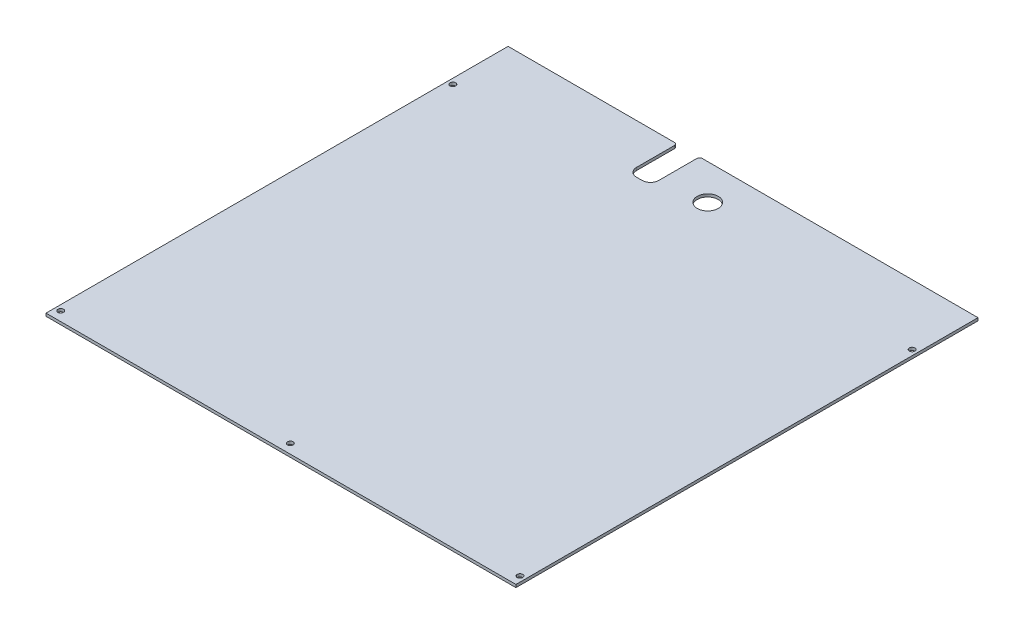
ISO-10303-21;
HEADER;
FILE_DESCRIPTION(('STEP AP214'),'2;1');
FILE_NAME('part.step','',(''),(''),'','','');
FILE_SCHEMA(('AUTOMOTIVE_DESIGN { 1 0 10303 214 1 1 1 1 }'));
ENDSEC;
DATA;
#1=APPLICATION_CONTEXT('core data for automotive mechanical design processes');
#2=APPLICATION_PROTOCOL_DEFINITION('international standard','automotive_design',2000,#1);
#3=PRODUCT_CONTEXT('',#1,'mechanical');
#4=PRODUCT('Part','Part','',(#3));
#5=PRODUCT_RELATED_PRODUCT_CATEGORY('part','',(#4));
#6=PRODUCT_DEFINITION_FORMATION('','',#4);
#7=PRODUCT_DEFINITION_CONTEXT('part definition',#1,'design');
#8=PRODUCT_DEFINITION('design','',#6,#7);
#9=PRODUCT_DEFINITION_SHAPE('','',#8);
#10=(LENGTH_UNIT() NAMED_UNIT(*) SI_UNIT(.MILLI.,.METRE.));
#11=(NAMED_UNIT(*) PLANE_ANGLE_UNIT() SI_UNIT($,.RADIAN.));
#12=(NAMED_UNIT(*) SI_UNIT($,.STERADIAN.) SOLID_ANGLE_UNIT());
#13=UNCERTAINTY_MEASURE_WITH_UNIT(LENGTH_MEASURE(1.E-05),#10,'distance_accuracy_value','');
#14=(GEOMETRIC_REPRESENTATION_CONTEXT(3) GLOBAL_UNCERTAINTY_ASSIGNED_CONTEXT((#13)) GLOBAL_UNIT_ASSIGNED_CONTEXT((#10,
#11,#12)) REPRESENTATION_CONTEXT('',''));
#15=CARTESIAN_POINT('',(0.,0.,0.));
#16=DIRECTION('',(0.,0.,1.));
#17=DIRECTION('',(1.,0.,0.));
#18=AXIS2_PLACEMENT_3D('',#15,#16,#17);
#19=CARTESIAN_POINT('',(-167.5,-2.,-121.41));
#20=DIRECTION('',(0.,0.,-1.));
#21=DIRECTION('',(-1.,0.,0.));
#22=AXIS2_PLACEMENT_3D('',#19,#20,#21);
#23=PLANE('',#22);
#24=DIRECTION('',(-1.,0.,0.));
#25=VECTOR('',#24,1.);
#26=CARTESIAN_POINT('',(-167.5,0.,-121.41));
#27=LINE('',#26,#25);
#28=CARTESIAN_POINT('',(-49.,0.,-121.41));
#29=VERTEX_POINT('',#28);
#30=CARTESIAN_POINT('',(-167.5,0.,-121.41));
#31=VERTEX_POINT('',#30);
#32=EDGE_CURVE('E177',#29,#31,#27,.T.);
#33=ORIENTED_EDGE('',*,*,#32,.F.);
#34=DIRECTION('',(0.,1.,0.));
#35=VECTOR('',#34,1.);
#36=CARTESIAN_POINT('',(-49.,-2.,-121.41));
#37=LINE('',#36,#35);
#38=CARTESIAN_POINT('',(-49.,-2.,-121.41));
#39=VERTEX_POINT('',#38);
#40=EDGE_CURVE('E11',#29,#39,#37,.F.);
#41=ORIENTED_EDGE('',*,*,#40,.T.);
#42=DIRECTION('',(-1.,0.,0.));
#43=VECTOR('',#42,1.);
#44=CARTESIAN_POINT('',(-167.5,-2.,-121.41));
#45=LINE('',#44,#43);
#46=CARTESIAN_POINT('',(-167.5,-2.,-121.41));
#47=VERTEX_POINT('',#46);
#48=EDGE_CURVE('E159',#39,#47,#45,.T.);
#49=ORIENTED_EDGE('',*,*,#48,.T.);
#50=DIRECTION('',(0.,1.,0.));
#51=VECTOR('',#50,1.);
#52=CARTESIAN_POINT('',(-167.5,-2.,-121.41));
#53=LINE('',#52,#51);
#54=EDGE_CURVE('E146',#47,#31,#53,.T.);
#55=ORIENTED_EDGE('',*,*,#54,.T.);
#56=EDGE_LOOP('',(#33,#41,#49,#55));
#57=FACE_BOUND('',#56,.T.);
#58=ADVANCED_FACE('F46',(#57),#23,.T.);
#59=CARTESIAN_POINT('',(167.5,-2.,207.99));
#60=DIRECTION('',(1.,0.,0.));
#61=DIRECTION('',(0.,0.,-1.));
#62=AXIS2_PLACEMENT_3D('',#59,#60,#61);
#63=PLANE('',#62);
#64=DIRECTION('',(0.,0.,-1.));
#65=VECTOR('',#64,1.);
#66=CARTESIAN_POINT('',(167.5,0.,207.99));
#67=LINE('',#66,#65);
#68=CARTESIAN_POINT('',(167.5,0.,207.99));
#69=VERTEX_POINT('',#68);
#70=CARTESIAN_POINT('',(167.5,0.,-121.41));
#71=VERTEX_POINT('',#70);
#72=EDGE_CURVE('E175',#69,#71,#67,.T.);
#73=ORIENTED_EDGE('',*,*,#72,.F.);
#74=DIRECTION('',(0.,1.,0.));
#75=VECTOR('',#74,1.);
#76=CARTESIAN_POINT('',(167.5,-2.,207.99));
#77=LINE('',#76,#75);
#78=CARTESIAN_POINT('',(167.5,-2.,207.99));
#79=VERTEX_POINT('',#78);
#80=EDGE_CURVE('E162',#79,#69,#77,.T.);
#81=ORIENTED_EDGE('',*,*,#80,.F.);
#82=DIRECTION('',(0.,0.,-1.));
#83=VECTOR('',#82,1.);
#84=CARTESIAN_POINT('',(167.5,-2.,207.99));
#85=LINE('',#84,#83);
#86=CARTESIAN_POINT('',(167.5,-2.,-121.41));
#87=VERTEX_POINT('',#86);
#88=EDGE_CURVE('E154',#79,#87,#85,.T.);
#89=ORIENTED_EDGE('',*,*,#88,.T.);
#90=DIRECTION('',(0.,1.,0.));
#91=VECTOR('',#90,1.);
#92=CARTESIAN_POINT('',(167.5,-2.,-121.41));
#93=LINE('',#92,#91);
#94=EDGE_CURVE('E134',#87,#71,#93,.T.);
#95=ORIENTED_EDGE('',*,*,#94,.T.);
#96=EDGE_LOOP('',(#73,#81,#89,#95));
#97=FACE_BOUND('',#96,.T.);
#98=ADVANCED_FACE('F161',(#97),#63,.T.);
#99=CARTESIAN_POINT('',(-167.5,-2.,207.99));
#100=DIRECTION('',(0.,0.,1.));
#101=DIRECTION('',(1.,0.,0.));
#102=AXIS2_PLACEMENT_3D('',#99,#100,#101);
#103=PLANE('',#102);
#104=DIRECTION('',(1.,0.,0.));
#105=VECTOR('',#104,1.);
#106=CARTESIAN_POINT('',(-167.5,0.,207.99));
#107=LINE('',#106,#105);
#108=CARTESIAN_POINT('',(-167.5,0.,207.99));
#109=VERTEX_POINT('',#108);
#110=EDGE_CURVE('E163',#109,#69,#107,.T.);
#111=ORIENTED_EDGE('',*,*,#110,.F.);
#112=DIRECTION('',(0.,1.,0.));
#113=VECTOR('',#112,1.);
#114=CARTESIAN_POINT('',(-167.5,-2.,207.99));
#115=LINE('',#114,#113);
#116=CARTESIAN_POINT('',(-167.5,-2.,207.99));
#117=VERTEX_POINT('',#116);
#118=EDGE_CURVE('E184',#117,#109,#115,.T.);
#119=ORIENTED_EDGE('',*,*,#118,.F.);
#120=DIRECTION('',(1.,0.,0.));
#121=VECTOR('',#120,1.);
#122=CARTESIAN_POINT('',(-167.5,-2.,207.99));
#123=LINE('',#122,#121);
#124=EDGE_CURVE('E147',#117,#79,#123,.T.);
#125=ORIENTED_EDGE('',*,*,#124,.T.);
#126=ORIENTED_EDGE('',*,*,#80,.T.);
#127=EDGE_LOOP('',(#111,#119,#125,#126));
#128=FACE_BOUND('',#127,.T.);
#129=ADVANCED_FACE('F294',(#128),#103,.T.);
#130=CARTESIAN_POINT('',(-167.5,-2.,207.99));
#131=DIRECTION('',(-1.,0.,0.));
#132=DIRECTION('',(0.,0.,1.));
#133=AXIS2_PLACEMENT_3D('',#130,#131,#132);
#134=PLANE('',#133);
#135=DIRECTION('',(0.,0.,1.));
#136=VECTOR('',#135,1.);
#137=CARTESIAN_POINT('',(-167.5,0.,207.99));
#138=LINE('',#137,#136);
#139=EDGE_CURVE('E166',#31,#109,#138,.T.);
#140=ORIENTED_EDGE('',*,*,#139,.F.);
#141=ORIENTED_EDGE('',*,*,#54,.F.);
#142=DIRECTION('',(0.,0.,1.));
#143=VECTOR('',#142,1.);
#144=CARTESIAN_POINT('',(-167.5,-2.,207.99));
#145=LINE('',#144,#143);
#146=EDGE_CURVE('E158',#47,#117,#145,.T.);
#147=ORIENTED_EDGE('',*,*,#146,.T.);
#148=ORIENTED_EDGE('',*,*,#118,.T.);
#149=EDGE_LOOP('',(#140,#141,#147,#148));
#150=FACE_BOUND('',#149,.T.);
#151=ADVANCED_FACE('F298',(#150),#134,.T.);
#152=CARTESIAN_POINT('',(-29.,-2.,-121.41));
#153=VERTEX_POINT('',#152);
#154=EDGE_CURVE('E138',#87,#153,#45,.T.);
#155=ORIENTED_EDGE('',*,*,#154,.T.);
#156=DIRECTION('',(0.,1.,0.));
#157=VECTOR('',#156,1.);
#158=CARTESIAN_POINT('',(-29.,0.,-121.41));
#159=LINE('',#158,#157);
#160=CARTESIAN_POINT('',(-29.,0.,-121.41));
#161=VERTEX_POINT('',#160);
#162=EDGE_CURVE('E207',#153,#161,#159,.T.);
#163=ORIENTED_EDGE('',*,*,#162,.T.);
#164=EDGE_CURVE('E141',#71,#161,#27,.T.);
#165=ORIENTED_EDGE('',*,*,#164,.F.);
#166=ORIENTED_EDGE('',*,*,#94,.F.);
#167=EDGE_LOOP('',(#155,#163,#165,#166));
#168=FACE_BOUND('',#167,.T.);
#169=ADVANCED_FACE('F136',(#168),#23,.T.);
#170=CARTESIAN_POINT('',(0.,-2.,0.));
#171=DIRECTION('',(0.,-1.,0.));
#172=DIRECTION('',(0.,0.,-1.));
#173=AXIS2_PLACEMENT_3D('',#170,#171,#172);
#174=PLANE('',#173);
#175=DIRECTION('',(0.,0.,-1.));
#176=VECTOR('',#175,1.);
#177=CARTESIAN_POINT('',(-31.,-2.,-121.41));
#178=LINE('',#177,#176);
#179=CARTESIAN_POINT('',(-31.,-2.,-92.41));
#180=VERTEX_POINT('',#179);
#181=CARTESIAN_POINT('',(-31.,-2.,-119.41));
#182=VERTEX_POINT('',#181);
#183=EDGE_CURVE('E234',#180,#182,#178,.T.);
#184=ORIENTED_EDGE('',*,*,#183,.T.);
#185=CARTESIAN_POINT('',(-29.,-2.,-119.41));
#186=DIRECTION('',(0.,-1.,0.));
#187=DIRECTION('',(0.,0.,-1.));
#188=AXIS2_PLACEMENT_3D('',#185,#186,#187);
#189=CIRCLE('',#188,2.);
#190=EDGE_CURVE('E157',#182,#153,#189,.T.);
#191=ORIENTED_EDGE('',*,*,#190,.T.);
#192=ORIENTED_EDGE('',*,*,#154,.F.);
#193=ORIENTED_EDGE('',*,*,#88,.F.);
#194=ORIENTED_EDGE('',*,*,#124,.F.);
#195=ORIENTED_EDGE('',*,*,#146,.F.);
#196=ORIENTED_EDGE('',*,*,#48,.F.);
#197=CARTESIAN_POINT('',(-49.,-2.,-119.41));
#198=DIRECTION('',(0.,-1.,0.));
#199=DIRECTION('',(0.,0.,-1.));
#200=AXIS2_PLACEMENT_3D('',#197,#198,#199);
#201=CIRCLE('',#200,2.);
#202=CARTESIAN_POINT('',(-47.,-2.,-119.41));
#203=VERTEX_POINT('',#202);
#204=EDGE_CURVE('E66',#39,#203,#201,.T.);
#205=ORIENTED_EDGE('',*,*,#204,.T.);
#206=DIRECTION('',(0.,0.,1.));
#207=VECTOR('',#206,1.);
#208=CARTESIAN_POINT('',(-47.,-2.,-121.41));
#209=LINE('',#208,#207);
#210=CARTESIAN_POINT('',(-47.,-2.,-92.41));
#211=VERTEX_POINT('',#210);
#212=EDGE_CURVE('E222',#203,#211,#209,.T.);
#213=ORIENTED_EDGE('',*,*,#212,.T.);
#214=CARTESIAN_POINT('',(-41.,-2.,-92.41));
#215=DIRECTION('',(0.,-1.,0.));
#216=DIRECTION('',(0.,0.,-1.));
#217=AXIS2_PLACEMENT_3D('',#214,#215,#216);
#218=CIRCLE('',#217,6.);
#219=CARTESIAN_POINT('',(-41.,-2.,-86.41));
#220=VERTEX_POINT('',#219);
#221=EDGE_CURVE('E205',#211,#220,#218,.F.);
#222=ORIENTED_EDGE('',*,*,#221,.T.);
#223=DIRECTION('',(1.,0.,0.));
#224=VECTOR('',#223,1.);
#225=CARTESIAN_POINT('',(-47.,-2.,-86.41));
#226=LINE('',#225,#224);
#227=CARTESIAN_POINT('',(-37.,-2.,-86.41));
#228=VERTEX_POINT('',#227);
#229=EDGE_CURVE('E343',#220,#228,#226,.T.);
#230=ORIENTED_EDGE('',*,*,#229,.T.);
#231=CARTESIAN_POINT('',(-37.,-2.,-92.41));
#232=DIRECTION('',(0.,-1.,0.));
#233=DIRECTION('',(0.,0.,-1.));
#234=AXIS2_PLACEMENT_3D('',#231,#232,#233);
#235=CIRCLE('',#234,6.);
#236=EDGE_CURVE('E200',#228,#180,#235,.F.);
#237=ORIENTED_EDGE('',*,*,#236,.T.);
#238=EDGE_LOOP('',(#184,#191,#192,#193,#194,#195,#196,#205,#213,#222,#230,#237));
#239=FACE_BOUND('',#238,.T.);
#240=CARTESIAN_POINT('',(0.,-2.,-96.25));
#241=DIRECTION('',(0.,-1.,0.));
#242=DIRECTION('',(0.,0.,-1.));
#243=AXIS2_PLACEMENT_3D('',#240,#241,#242);
#244=CIRCLE('',#243,7.5);
#245=CARTESIAN_POINT('',(0.,-2.,-103.75));
#246=VERTEX_POINT('',#245);
#247=EDGE_CURVE('E243',#246,#246,#244,.F.);
#248=ORIENTED_EDGE('',*,*,#247,.T.);
#249=EDGE_LOOP('',(#248));
#250=FACE_BOUND('',#249,.T.);
#251=CARTESIAN_POINT('',(0.,-2.,201.3));
#252=DIRECTION('',(0.,-1.,0.));
#253=DIRECTION('',(0.,0.,-1.));
#254=AXIS2_PLACEMENT_3D('',#251,#252,#253);
#255=CIRCLE('',#254,2.);
#256=CARTESIAN_POINT('',(0.,-2.,199.3));
#257=VERTEX_POINT('',#256);
#258=EDGE_CURVE('E242',#257,#257,#255,.F.);
#259=ORIENTED_EDGE('',*,*,#258,.T.);
#260=EDGE_LOOP('',(#259));
#261=FACE_BOUND('',#260,.T.);
#262=CARTESIAN_POINT('',(163.7,-2.,201.3));
#263=DIRECTION('',(0.,-1.,0.));
#264=DIRECTION('',(0.,0.,-1.));
#265=AXIS2_PLACEMENT_3D('',#262,#263,#264);
#266=CIRCLE('',#265,2.);
#267=CARTESIAN_POINT('',(163.7,-2.,199.3));
#268=VERTEX_POINT('',#267);
#269=EDGE_CURVE('E249',#268,#268,#266,.F.);
#270=ORIENTED_EDGE('',*,*,#269,.T.);
#271=EDGE_LOOP('',(#270));
#272=FACE_BOUND('',#271,.T.);
#273=CARTESIAN_POINT('',(163.7,-2.,-78.26));
#274=DIRECTION('',(0.,-1.,0.));
#275=DIRECTION('',(0.,0.,-1.));
#276=AXIS2_PLACEMENT_3D('',#273,#274,#275);
#277=CIRCLE('',#276,2.);
#278=CARTESIAN_POINT('',(163.7,-2.,-80.26));
#279=VERTEX_POINT('',#278);
#280=EDGE_CURVE('E255',#279,#279,#277,.F.);
#281=ORIENTED_EDGE('',*,*,#280,.T.);
#282=EDGE_LOOP('',(#281));
#283=FACE_BOUND('',#282,.T.);
#284=CARTESIAN_POINT('',(-163.7,-2.,-78.2599999999999));
#285=DIRECTION('',(0.,-1.,0.));
#286=DIRECTION('',(0.,0.,-1.));
#287=AXIS2_PLACEMENT_3D('',#284,#285,#286);
#288=CIRCLE('',#287,2.);
#289=CARTESIAN_POINT('',(-163.7,-2.,-80.2599999999999));
#290=VERTEX_POINT('',#289);
#291=EDGE_CURVE('E261',#290,#290,#288,.F.);
#292=ORIENTED_EDGE('',*,*,#291,.T.);
#293=EDGE_LOOP('',(#292));
#294=FACE_BOUND('',#293,.T.);
#295=CARTESIAN_POINT('',(-163.7,-2.,201.3));
#296=DIRECTION('',(0.,-1.,0.));
#297=DIRECTION('',(0.,0.,-1.));
#298=AXIS2_PLACEMENT_3D('',#295,#296,#297);
#299=CIRCLE('',#298,2.);
#300=CARTESIAN_POINT('',(-163.7,-2.,199.3));
#301=VERTEX_POINT('',#300);
#302=EDGE_CURVE('E169',#301,#301,#299,.F.);
#303=ORIENTED_EDGE('',*,*,#302,.T.);
#304=EDGE_LOOP('',(#303));
#305=FACE_BOUND('',#304,.T.);
#306=ADVANCED_FACE('F151',(#239,#250,#261,#272,#283,#294,#305),#174,.T.);
#307=CARTESIAN_POINT('',(0.,0.,0.));
#308=DIRECTION('',(0.,-1.,0.));
#309=DIRECTION('',(0.,0.,-1.));
#310=AXIS2_PLACEMENT_3D('',#307,#308,#309);
#311=PLANE('',#310);
#312=CARTESIAN_POINT('',(0.,0.,-96.25));
#313=DIRECTION('',(0.,1.,0.));
#314=DIRECTION('',(0.,0.,1.));
#315=AXIS2_PLACEMENT_3D('',#312,#313,#314);
#316=CIRCLE('',#315,7.5);
#317=CARTESIAN_POINT('',(0.,0.,-88.75));
#318=VERTEX_POINT('',#317);
#319=EDGE_CURVE('E239',#318,#318,#316,.T.);
#320=ORIENTED_EDGE('',*,*,#319,.F.);
#321=EDGE_LOOP('',(#320));
#322=FACE_BOUND('',#321,.T.);
#323=CARTESIAN_POINT('',(0.,0.,201.3));
#324=DIRECTION('',(0.,1.,0.));
#325=DIRECTION('',(0.,0.,1.));
#326=AXIS2_PLACEMENT_3D('',#323,#324,#325);
#327=CIRCLE('',#326,2.);
#328=CARTESIAN_POINT('',(0.,0.,203.3));
#329=VERTEX_POINT('',#328);
#330=EDGE_CURVE('E246',#329,#329,#327,.T.);
#331=ORIENTED_EDGE('',*,*,#330,.F.);
#332=EDGE_LOOP('',(#331));
#333=FACE_BOUND('',#332,.T.);
#334=CARTESIAN_POINT('',(163.7,0.,201.3));
#335=DIRECTION('',(0.,1.,0.));
#336=DIRECTION('',(0.,0.,-1.));
#337=AXIS2_PLACEMENT_3D('',#334,#335,#336);
#338=CIRCLE('',#337,2.);
#339=CARTESIAN_POINT('',(163.7,0.,199.3));
#340=VERTEX_POINT('',#339);
#341=EDGE_CURVE('E252',#340,#340,#338,.T.);
#342=ORIENTED_EDGE('',*,*,#341,.F.);
#343=EDGE_LOOP('',(#342));
#344=FACE_BOUND('',#343,.T.);
#345=CARTESIAN_POINT('',(163.7,0.,-78.26));
#346=DIRECTION('',(0.,1.,0.));
#347=DIRECTION('',(0.,0.,-1.));
#348=AXIS2_PLACEMENT_3D('',#345,#346,#347);
#349=CIRCLE('',#348,2.);
#350=CARTESIAN_POINT('',(163.7,0.,-80.26));
#351=VERTEX_POINT('',#350);
#352=EDGE_CURVE('E258',#351,#351,#349,.T.);
#353=ORIENTED_EDGE('',*,*,#352,.F.);
#354=EDGE_LOOP('',(#353));
#355=FACE_BOUND('',#354,.T.);
#356=CARTESIAN_POINT('',(-163.7,0.,-78.2599999999999));
#357=DIRECTION('',(0.,1.,0.));
#358=DIRECTION('',(0.,0.,1.));
#359=AXIS2_PLACEMENT_3D('',#356,#357,#358);
#360=CIRCLE('',#359,2.);
#361=CARTESIAN_POINT('',(-163.7,0.,-76.2599999999999));
#362=VERTEX_POINT('',#361);
#363=EDGE_CURVE('E264',#362,#362,#360,.T.);
#364=ORIENTED_EDGE('',*,*,#363,.F.);
#365=EDGE_LOOP('',(#364));
#366=FACE_BOUND('',#365,.T.);
#367=CARTESIAN_POINT('',(-163.7,0.,201.3));
#368=DIRECTION('',(0.,1.,0.));
#369=DIRECTION('',(0.,0.,1.));
#370=AXIS2_PLACEMENT_3D('',#367,#368,#369);
#371=CIRCLE('',#370,2.);
#372=CARTESIAN_POINT('',(-163.7,0.,203.3));
#373=VERTEX_POINT('',#372);
#374=EDGE_CURVE('E178',#373,#373,#371,.T.);
#375=ORIENTED_EDGE('',*,*,#374,.F.);
#376=EDGE_LOOP('',(#375));
#377=FACE_BOUND('',#376,.T.);
#378=ORIENTED_EDGE('',*,*,#164,.T.);
#379=CARTESIAN_POINT('',(-29.,0.,-119.41));
#380=DIRECTION('',(0.,-1.,0.));
#381=DIRECTION('',(0.,0.,-1.));
#382=AXIS2_PLACEMENT_3D('',#379,#380,#381);
#383=CIRCLE('',#382,2.);
#384=CARTESIAN_POINT('',(-31.,0.,-119.41));
#385=VERTEX_POINT('',#384);
#386=EDGE_CURVE('E211',#161,#385,#383,.F.);
#387=ORIENTED_EDGE('',*,*,#386,.T.);
#388=DIRECTION('',(0.,0.,-1.));
#389=VECTOR('',#388,1.);
#390=CARTESIAN_POINT('',(-31.,0.,-121.41));
#391=LINE('',#390,#389);
#392=CARTESIAN_POINT('',(-31.,0.,-92.41));
#393=VERTEX_POINT('',#392);
#394=EDGE_CURVE('E231',#393,#385,#391,.T.);
#395=ORIENTED_EDGE('',*,*,#394,.F.);
#396=CARTESIAN_POINT('',(-37.,0.,-92.41));
#397=DIRECTION('',(0.,-1.,0.));
#398=DIRECTION('',(0.,0.,-1.));
#399=AXIS2_PLACEMENT_3D('',#396,#397,#398);
#400=CIRCLE('',#399,6.);
#401=CARTESIAN_POINT('',(-37.,0.,-86.41));
#402=VERTEX_POINT('',#401);
#403=EDGE_CURVE('E198',#393,#402,#400,.T.);
#404=ORIENTED_EDGE('',*,*,#403,.T.);
#405=DIRECTION('',(1.,0.,0.));
#406=VECTOR('',#405,1.);
#407=CARTESIAN_POINT('',(-47.,0.,-86.41));
#408=LINE('',#407,#406);
#409=CARTESIAN_POINT('',(-41.,0.,-86.41));
#410=VERTEX_POINT('',#409);
#411=EDGE_CURVE('E228',#410,#402,#408,.T.);
#412=ORIENTED_EDGE('',*,*,#411,.F.);
#413=CARTESIAN_POINT('',(-41.,0.,-92.41));
#414=DIRECTION('',(0.,-1.,0.));
#415=DIRECTION('',(0.,0.,-1.));
#416=AXIS2_PLACEMENT_3D('',#413,#414,#415);
#417=CIRCLE('',#416,6.);
#418=CARTESIAN_POINT('',(-47.,0.,-92.41));
#419=VERTEX_POINT('',#418);
#420=EDGE_CURVE('E202',#410,#419,#417,.T.);
#421=ORIENTED_EDGE('',*,*,#420,.T.);
#422=DIRECTION('',(0.,0.,1.));
#423=VECTOR('',#422,1.);
#424=CARTESIAN_POINT('',(-47.,0.,-121.41));
#425=LINE('',#424,#423);
#426=CARTESIAN_POINT('',(-47.,0.,-119.41));
#427=VERTEX_POINT('',#426);
#428=EDGE_CURVE('E221',#427,#419,#425,.T.);
#429=ORIENTED_EDGE('',*,*,#428,.F.);
#430=CARTESIAN_POINT('',(-49.,0.,-119.41));
#431=DIRECTION('',(0.,-1.,0.));
#432=DIRECTION('',(0.,0.,-1.));
#433=AXIS2_PLACEMENT_3D('',#430,#431,#432);
#434=CIRCLE('',#433,2.);
#435=EDGE_CURVE('E209',#427,#29,#434,.F.);
#436=ORIENTED_EDGE('',*,*,#435,.T.);
#437=ORIENTED_EDGE('',*,*,#32,.T.);
#438=ORIENTED_EDGE('',*,*,#139,.T.);
#439=ORIENTED_EDGE('',*,*,#110,.T.);
#440=ORIENTED_EDGE('',*,*,#72,.T.);
#441=EDGE_LOOP('',(#378,#387,#395,#404,#412,#421,#429,#436,#437,#438,#439,#440));
#442=FACE_BOUND('',#441,.T.);
#443=ADVANCED_FACE('F225',(#322,#333,#344,#355,#366,#377,#442),#311,.F.);
#444=CARTESIAN_POINT('',(-163.7,-2.001,201.3));
#445=DIRECTION('',(0.,1.,0.));
#446=DIRECTION('',(0.,0.,1.));
#447=AXIS2_PLACEMENT_3D('',#444,#445,#446);
#448=CYLINDRICAL_SURFACE('',#447,2.);
#449=ORIENTED_EDGE('',*,*,#302,.F.);
#450=EDGE_LOOP('',(#449));
#451=FACE_BOUND('',#450,.T.);
#452=ORIENTED_EDGE('',*,*,#374,.T.);
#453=EDGE_LOOP('',(#452));
#454=FACE_BOUND('',#453,.T.);
#455=ADVANCED_FACE('F275',(#451,#454),#448,.F.);
#456=CARTESIAN_POINT('',(-163.7,-2.001,-78.2599999999999));
#457=DIRECTION('',(0.,1.,0.));
#458=DIRECTION('',(0.,0.,1.));
#459=AXIS2_PLACEMENT_3D('',#456,#457,#458);
#460=CYLINDRICAL_SURFACE('',#459,2.);
#461=ORIENTED_EDGE('',*,*,#291,.F.);
#462=EDGE_LOOP('',(#461));
#463=FACE_BOUND('',#462,.T.);
#464=ORIENTED_EDGE('',*,*,#363,.T.);
#465=EDGE_LOOP('',(#464));
#466=FACE_BOUND('',#465,.T.);
#467=ADVANCED_FACE('F277',(#463,#466),#460,.F.);
#468=CARTESIAN_POINT('',(163.7,-2.001,-78.26));
#469=DIRECTION('',(0.,1.,0.));
#470=DIRECTION('',(0.,0.,1.));
#471=AXIS2_PLACEMENT_3D('',#468,#469,#470);
#472=CYLINDRICAL_SURFACE('',#471,2.);
#473=ORIENTED_EDGE('',*,*,#280,.F.);
#474=EDGE_LOOP('',(#473));
#475=FACE_BOUND('',#474,.T.);
#476=ORIENTED_EDGE('',*,*,#352,.T.);
#477=EDGE_LOOP('',(#476));
#478=FACE_BOUND('',#477,.T.);
#479=ADVANCED_FACE('F283',(#475,#478),#472,.F.);
#480=CARTESIAN_POINT('',(163.7,-2.001,201.3));
#481=DIRECTION('',(0.,1.,0.));
#482=DIRECTION('',(0.,0.,1.));
#483=AXIS2_PLACEMENT_3D('',#480,#481,#482);
#484=CYLINDRICAL_SURFACE('',#483,2.);
#485=ORIENTED_EDGE('',*,*,#269,.F.);
#486=EDGE_LOOP('',(#485));
#487=FACE_BOUND('',#486,.T.);
#488=ORIENTED_EDGE('',*,*,#341,.T.);
#489=EDGE_LOOP('',(#488));
#490=FACE_BOUND('',#489,.T.);
#491=ADVANCED_FACE('F361',(#487,#490),#484,.F.);
#492=CARTESIAN_POINT('',(0.,-2.001,201.3));
#493=DIRECTION('',(0.,1.,0.));
#494=DIRECTION('',(0.,0.,1.));
#495=AXIS2_PLACEMENT_3D('',#492,#493,#494);
#496=CYLINDRICAL_SURFACE('',#495,2.);
#497=ORIENTED_EDGE('',*,*,#258,.F.);
#498=EDGE_LOOP('',(#497));
#499=FACE_BOUND('',#498,.T.);
#500=ORIENTED_EDGE('',*,*,#330,.T.);
#501=EDGE_LOOP('',(#500));
#502=FACE_BOUND('',#501,.T.);
#503=ADVANCED_FACE('F357',(#499,#502),#496,.F.);
#504=CARTESIAN_POINT('',(0.,-2.001,-96.25));
#505=DIRECTION('',(0.,1.,0.));
#506=DIRECTION('',(0.,0.,1.));
#507=AXIS2_PLACEMENT_3D('',#504,#505,#506);
#508=CYLINDRICAL_SURFACE('',#507,7.5);
#509=ORIENTED_EDGE('',*,*,#247,.F.);
#510=EDGE_LOOP('',(#509));
#511=FACE_BOUND('',#510,.T.);
#512=ORIENTED_EDGE('',*,*,#319,.T.);
#513=EDGE_LOOP('',(#512));
#514=FACE_BOUND('',#513,.T.);
#515=ADVANCED_FACE('F354',(#511,#514),#508,.F.);
#516=CARTESIAN_POINT('',(-47.,-2.,-121.41));
#517=DIRECTION('',(-1.,0.,0.));
#518=DIRECTION('',(0.,0.,1.));
#519=AXIS2_PLACEMENT_3D('',#516,#517,#518);
#520=PLANE('',#519);
#521=ORIENTED_EDGE('',*,*,#212,.F.);
#522=DIRECTION('',(0.,1.,0.));
#523=VECTOR('',#522,1.);
#524=CARTESIAN_POINT('',(-47.,0.,-119.41));
#525=LINE('',#524,#523);
#526=EDGE_CURVE('E54',#203,#427,#525,.T.);
#527=ORIENTED_EDGE('',*,*,#526,.T.);
#528=ORIENTED_EDGE('',*,*,#428,.T.);
#529=DIRECTION('',(0.,1.,0.));
#530=VECTOR('',#529,1.);
#531=CARTESIAN_POINT('',(-47.,-2.,-92.41));
#532=LINE('',#531,#530);
#533=EDGE_CURVE('E195',#419,#211,#532,.F.);
#534=ORIENTED_EDGE('',*,*,#533,.T.);
#535=EDGE_LOOP('',(#521,#527,#528,#534));
#536=FACE_BOUND('',#535,.T.);
#537=ADVANCED_FACE('F220',(#536),#520,.F.);
#538=CARTESIAN_POINT('',(-31.,-2.,-121.41));
#539=DIRECTION('',(1.,0.,0.));
#540=DIRECTION('',(0.,0.,-1.));
#541=AXIS2_PLACEMENT_3D('',#538,#539,#540);
#542=PLANE('',#541);
#543=ORIENTED_EDGE('',*,*,#394,.T.);
#544=DIRECTION('',(0.,1.,0.));
#545=VECTOR('',#544,1.);
#546=CARTESIAN_POINT('',(-31.,-2.,-119.41));
#547=LINE('',#546,#545);
#548=EDGE_CURVE('E213',#385,#182,#547,.F.);
#549=ORIENTED_EDGE('',*,*,#548,.T.);
#550=ORIENTED_EDGE('',*,*,#183,.F.);
#551=DIRECTION('',(0.,1.,0.));
#552=VECTOR('',#551,1.);
#553=CARTESIAN_POINT('',(-31.,0.,-92.41));
#554=LINE('',#553,#552);
#555=EDGE_CURVE('E183',#180,#393,#554,.T.);
#556=ORIENTED_EDGE('',*,*,#555,.T.);
#557=EDGE_LOOP('',(#543,#549,#550,#556));
#558=FACE_BOUND('',#557,.T.);
#559=ADVANCED_FACE('F317',(#558),#542,.F.);
#560=CARTESIAN_POINT('',(-47.,-2.,-86.41));
#561=DIRECTION('',(0.,0.,1.));
#562=DIRECTION('',(1.,0.,0.));
#563=AXIS2_PLACEMENT_3D('',#560,#561,#562);
#564=PLANE('',#563);
#565=ORIENTED_EDGE('',*,*,#411,.T.);
#566=DIRECTION('',(0.,1.,0.));
#567=VECTOR('',#566,1.);
#568=CARTESIAN_POINT('',(-37.,-2.,-86.41));
#569=LINE('',#568,#567);
#570=EDGE_CURVE('E193',#402,#228,#569,.F.);
#571=ORIENTED_EDGE('',*,*,#570,.T.);
#572=ORIENTED_EDGE('',*,*,#229,.F.);
#573=DIRECTION('',(0.,1.,0.));
#574=VECTOR('',#573,1.);
#575=CARTESIAN_POINT('',(-41.,0.,-86.41));
#576=LINE('',#575,#574);
#577=EDGE_CURVE('E190',#220,#410,#576,.T.);
#578=ORIENTED_EDGE('',*,*,#577,.T.);
#579=EDGE_LOOP('',(#565,#571,#572,#578));
#580=FACE_BOUND('',#579,.T.);
#581=ADVANCED_FACE('F332',(#580),#564,.F.);
#582=CARTESIAN_POINT('',(-37.,-2.,-92.41));
#583=DIRECTION('',(0.,-1.,0.));
#584=DIRECTION('',(0.,0.,-1.));
#585=AXIS2_PLACEMENT_3D('',#582,#583,#584);
#586=CYLINDRICAL_SURFACE('',#585,6.);
#587=ORIENTED_EDGE('',*,*,#236,.F.);
#588=ORIENTED_EDGE('',*,*,#570,.F.);
#589=ORIENTED_EDGE('',*,*,#403,.F.);
#590=ORIENTED_EDGE('',*,*,#555,.F.);
#591=EDGE_LOOP('',(#587,#588,#589,#590));
#592=FACE_BOUND('',#591,.T.);
#593=ADVANCED_FACE('F327',(#592),#586,.F.);
#594=CARTESIAN_POINT('',(-41.,-2.,-92.41));
#595=DIRECTION('',(0.,-1.,0.));
#596=DIRECTION('',(0.,0.,-1.));
#597=AXIS2_PLACEMENT_3D('',#594,#595,#596);
#598=CYLINDRICAL_SURFACE('',#597,6.);
#599=ORIENTED_EDGE('',*,*,#221,.F.);
#600=ORIENTED_EDGE('',*,*,#533,.F.);
#601=ORIENTED_EDGE('',*,*,#420,.F.);
#602=ORIENTED_EDGE('',*,*,#577,.F.);
#603=EDGE_LOOP('',(#599,#600,#601,#602));
#604=FACE_BOUND('',#603,.T.);
#605=ADVANCED_FACE('F322',(#604),#598,.F.);
#606=CARTESIAN_POINT('',(-29.,-2.,-119.41));
#607=DIRECTION('',(0.,-1.,0.));
#608=DIRECTION('',(0.,0.,-1.));
#609=AXIS2_PLACEMENT_3D('',#606,#607,#608);
#610=CYLINDRICAL_SURFACE('',#609,2.);
#611=ORIENTED_EDGE('',*,*,#190,.F.);
#612=ORIENTED_EDGE('',*,*,#548,.F.);
#613=ORIENTED_EDGE('',*,*,#386,.F.);
#614=ORIENTED_EDGE('',*,*,#162,.F.);
#615=EDGE_LOOP('',(#611,#612,#613,#614));
#616=FACE_BOUND('',#615,.T.);
#617=ADVANCED_FACE('F320',(#616),#610,.T.);
#618=CARTESIAN_POINT('',(-49.,-2.,-119.41));
#619=DIRECTION('',(0.,-1.,0.));
#620=DIRECTION('',(0.,0.,-1.));
#621=AXIS2_PLACEMENT_3D('',#618,#619,#620);
#622=CYLINDRICAL_SURFACE('',#621,2.);
#623=ORIENTED_EDGE('',*,*,#204,.F.);
#624=ORIENTED_EDGE('',*,*,#40,.F.);
#625=ORIENTED_EDGE('',*,*,#435,.F.);
#626=ORIENTED_EDGE('',*,*,#526,.F.);
#627=EDGE_LOOP('',(#623,#624,#625,#626));
#628=FACE_BOUND('',#627,.T.);
#629=ADVANCED_FACE('F48',(#628),#622,.T.);
#630=CLOSED_SHELL('',(#58,#98,#129,#151,#169,#306,#443,#455,#467,#479,#491,#503,#515,#537,#559,
#581,#593,#605,#617,#629));
#631=MANIFOLD_SOLID_BREP('B2',#630);
#632=ADVANCED_BREP_SHAPE_REPRESENTATION('',(#18,#631),#14);
#633=SHAPE_DEFINITION_REPRESENTATION(#9,#632);
ENDSEC;
END-ISO-10303-21;
